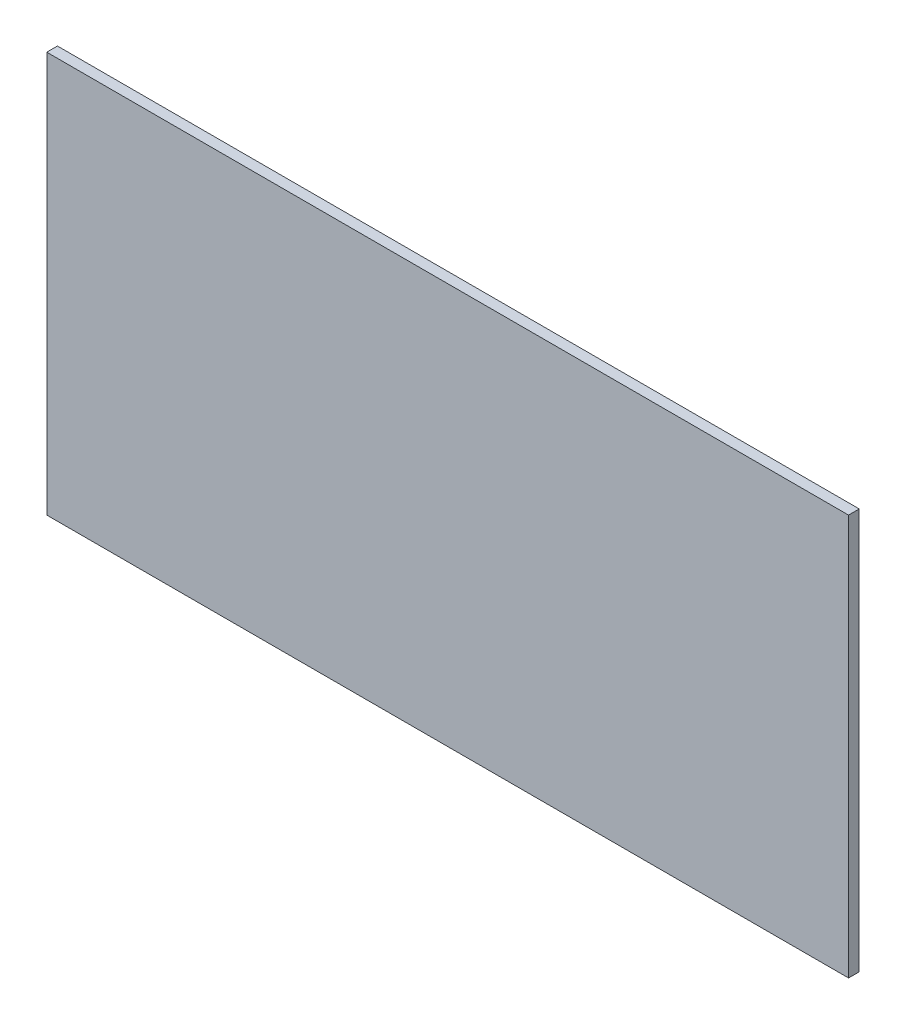
ISO-10303-21;
HEADER;
FILE_DESCRIPTION(('STEP AP214'),'2;1');
FILE_NAME('part.step','',(''),(''),'','','');
FILE_SCHEMA(('AUTOMOTIVE_DESIGN { 1 0 10303 214 1 1 1 1 }'));
ENDSEC;
DATA;
#1=APPLICATION_CONTEXT('core data for automotive mechanical design processes');
#2=APPLICATION_PROTOCOL_DEFINITION('international standard','automotive_design',2000,#1);
#3=PRODUCT_CONTEXT('',#1,'mechanical');
#4=PRODUCT('Part','Part','',(#3));
#5=PRODUCT_RELATED_PRODUCT_CATEGORY('part','',(#4));
#6=PRODUCT_DEFINITION_FORMATION('','',#4);
#7=PRODUCT_DEFINITION_CONTEXT('part definition',#1,'design');
#8=PRODUCT_DEFINITION('design','',#6,#7);
#9=PRODUCT_DEFINITION_SHAPE('','',#8);
#10=(LENGTH_UNIT() NAMED_UNIT(*) SI_UNIT(.MILLI.,.METRE.));
#11=(NAMED_UNIT(*) PLANE_ANGLE_UNIT() SI_UNIT($,.RADIAN.));
#12=(NAMED_UNIT(*) SI_UNIT($,.STERADIAN.) SOLID_ANGLE_UNIT());
#13=UNCERTAINTY_MEASURE_WITH_UNIT(LENGTH_MEASURE(1.E-05),#10,'distance_accuracy_value','');
#14=(GEOMETRIC_REPRESENTATION_CONTEXT(3) GLOBAL_UNCERTAINTY_ASSIGNED_CONTEXT((#13)) GLOBAL_UNIT_ASSIGNED_CONTEXT((#10,
#11,#12)) REPRESENTATION_CONTEXT('',''));
#15=CARTESIAN_POINT('',(0.,0.,0.));
#16=DIRECTION('',(0.,0.,1.));
#17=DIRECTION('',(1.,0.,0.));
#18=AXIS2_PLACEMENT_3D('',#15,#16,#17);
#19=CARTESIAN_POINT('',(450.,-225.,12.));
#20=DIRECTION('',(-1.,0.,0.));
#21=DIRECTION('',(0.,0.,1.));
#22=AXIS2_PLACEMENT_3D('',#19,#20,#21);
#23=PLANE('',#22);
#24=DIRECTION('',(0.,1.,0.));
#25=VECTOR('',#24,1.);
#26=CARTESIAN_POINT('',(450.,-225.,0.));
#27=LINE('',#26,#25);
#28=CARTESIAN_POINT('',(450.,-225.,0.));
#29=VERTEX_POINT('',#28);
#30=CARTESIAN_POINT('',(450.,225.,0.));
#31=VERTEX_POINT('',#30);
#32=EDGE_CURVE('E98',#29,#31,#27,.T.);
#33=ORIENTED_EDGE('',*,*,#32,.T.);
#34=DIRECTION('',(0.,0.,-1.));
#35=VECTOR('',#34,1.);
#36=CARTESIAN_POINT('',(450.,225.,12.));
#37=LINE('',#36,#35);
#38=CARTESIAN_POINT('',(450.,225.,12.));
#39=VERTEX_POINT('',#38);
#40=EDGE_CURVE('E11',#39,#31,#37,.T.);
#41=ORIENTED_EDGE('',*,*,#40,.F.);
#42=DIRECTION('',(0.,1.,0.));
#43=VECTOR('',#42,1.);
#44=CARTESIAN_POINT('',(450.,-225.,12.));
#45=LINE('',#44,#43);
#46=CARTESIAN_POINT('',(450.,-225.,12.));
#47=VERTEX_POINT('',#46);
#48=EDGE_CURVE('E86',#47,#39,#45,.T.);
#49=ORIENTED_EDGE('',*,*,#48,.F.);
#50=DIRECTION('',(0.,0.,-1.));
#51=VECTOR('',#50,1.);
#52=CARTESIAN_POINT('',(450.,-225.,12.));
#53=LINE('',#52,#51);
#54=EDGE_CURVE('E94',#47,#29,#53,.T.);
#55=ORIENTED_EDGE('',*,*,#54,.T.);
#56=EDGE_LOOP('',(#33,#41,#49,#55));
#57=FACE_BOUND('',#56,.T.);
#58=ADVANCED_FACE('F35',(#57),#23,.F.);
#59=CARTESIAN_POINT('',(-450.,225.,12.));
#60=DIRECTION('',(0.,-1.,0.));
#61=DIRECTION('',(0.,0.,-1.));
#62=AXIS2_PLACEMENT_3D('',#59,#60,#61);
#63=PLANE('',#62);
#64=DIRECTION('',(-1.,0.,0.));
#65=VECTOR('',#64,1.);
#66=CARTESIAN_POINT('',(-450.,225.,0.));
#67=LINE('',#66,#65);
#68=CARTESIAN_POINT('',(-450.,225.,0.));
#69=VERTEX_POINT('',#68);
#70=EDGE_CURVE('E90',#31,#69,#67,.T.);
#71=ORIENTED_EDGE('',*,*,#70,.T.);
#72=DIRECTION('',(0.,0.,-1.));
#73=VECTOR('',#72,1.);
#74=CARTESIAN_POINT('',(-450.,225.,12.));
#75=LINE('',#74,#73);
#76=CARTESIAN_POINT('',(-450.,225.,12.));
#77=VERTEX_POINT('',#76);
#78=EDGE_CURVE('E43',#77,#69,#75,.T.);
#79=ORIENTED_EDGE('',*,*,#78,.F.);
#80=DIRECTION('',(-1.,0.,0.));
#81=VECTOR('',#80,1.);
#82=CARTESIAN_POINT('',(-450.,225.,12.));
#83=LINE('',#82,#81);
#84=EDGE_CURVE('E81',#39,#77,#83,.T.);
#85=ORIENTED_EDGE('',*,*,#84,.F.);
#86=ORIENTED_EDGE('',*,*,#40,.T.);
#87=EDGE_LOOP('',(#71,#79,#85,#86));
#88=FACE_BOUND('',#87,.T.);
#89=ADVANCED_FACE('F89',(#88),#63,.F.);
#90=CARTESIAN_POINT('',(-450.,-225.,12.));
#91=DIRECTION('',(1.,0.,0.));
#92=DIRECTION('',(0.,0.,-1.));
#93=AXIS2_PLACEMENT_3D('',#90,#91,#92);
#94=PLANE('',#93);
#95=DIRECTION('',(0.,-1.,0.));
#96=VECTOR('',#95,1.);
#97=CARTESIAN_POINT('',(-450.,-225.,0.));
#98=LINE('',#97,#96);
#99=CARTESIAN_POINT('',(-450.,-225.,0.));
#100=VERTEX_POINT('',#99);
#101=EDGE_CURVE('E68',#69,#100,#98,.T.);
#102=ORIENTED_EDGE('',*,*,#101,.T.);
#103=DIRECTION('',(0.,0.,-1.));
#104=VECTOR('',#103,1.);
#105=CARTESIAN_POINT('',(-450.,-225.,12.));
#106=LINE('',#105,#104);
#107=CARTESIAN_POINT('',(-450.,-225.,12.));
#108=VERTEX_POINT('',#107);
#109=EDGE_CURVE('E91',#108,#100,#106,.T.);
#110=ORIENTED_EDGE('',*,*,#109,.F.);
#111=DIRECTION('',(0.,-1.,0.));
#112=VECTOR('',#111,1.);
#113=CARTESIAN_POINT('',(-450.,-225.,12.));
#114=LINE('',#113,#112);
#115=EDGE_CURVE('E84',#77,#108,#114,.T.);
#116=ORIENTED_EDGE('',*,*,#115,.F.);
#117=ORIENTED_EDGE('',*,*,#78,.T.);
#118=EDGE_LOOP('',(#102,#110,#116,#117));
#119=FACE_BOUND('',#118,.T.);
#120=ADVANCED_FACE('F92',(#119),#94,.F.);
#121=CARTESIAN_POINT('',(-450.,-225.,12.));
#122=DIRECTION('',(0.,1.,0.));
#123=DIRECTION('',(0.,0.,1.));
#124=AXIS2_PLACEMENT_3D('',#121,#122,#123);
#125=PLANE('',#124);
#126=DIRECTION('',(1.,0.,0.));
#127=VECTOR('',#126,1.);
#128=CARTESIAN_POINT('',(-450.,-225.,0.));
#129=LINE('',#128,#127);
#130=EDGE_CURVE('E74',#100,#29,#129,.T.);
#131=ORIENTED_EDGE('',*,*,#130,.T.);
#132=ORIENTED_EDGE('',*,*,#54,.F.);
#133=DIRECTION('',(1.,0.,0.));
#134=VECTOR('',#133,1.);
#135=CARTESIAN_POINT('',(-450.,-225.,12.));
#136=LINE('',#135,#134);
#137=EDGE_CURVE('E51',#108,#47,#136,.T.);
#138=ORIENTED_EDGE('',*,*,#137,.F.);
#139=ORIENTED_EDGE('',*,*,#109,.T.);
#140=EDGE_LOOP('',(#131,#132,#138,#139));
#141=FACE_BOUND('',#140,.T.);
#142=ADVANCED_FACE('F105',(#141),#125,.F.);
#143=CARTESIAN_POINT('',(0.,0.,12.));
#144=DIRECTION('',(0.,0.,-1.));
#145=DIRECTION('',(-1.,0.,0.));
#146=AXIS2_PLACEMENT_3D('',#143,#144,#145);
#147=PLANE('',#146);
#148=ORIENTED_EDGE('',*,*,#48,.T.);
#149=ORIENTED_EDGE('',*,*,#84,.T.);
#150=ORIENTED_EDGE('',*,*,#115,.T.);
#151=ORIENTED_EDGE('',*,*,#137,.T.);
#152=EDGE_LOOP('',(#148,#149,#150,#151));
#153=FACE_BOUND('',#152,.T.);
#154=ADVANCED_FACE('F82',(#153),#147,.F.);
#155=CARTESIAN_POINT('',(0.,0.,0.));
#156=DIRECTION('',(0.,0.,-1.));
#157=DIRECTION('',(-1.,0.,0.));
#158=AXIS2_PLACEMENT_3D('',#155,#156,#157);
#159=PLANE('',#158);
#160=ORIENTED_EDGE('',*,*,#32,.F.);
#161=ORIENTED_EDGE('',*,*,#130,.F.);
#162=ORIENTED_EDGE('',*,*,#101,.F.);
#163=ORIENTED_EDGE('',*,*,#70,.F.);
#164=EDGE_LOOP('',(#160,#161,#162,#163));
#165=FACE_BOUND('',#164,.T.);
#166=ADVANCED_FACE('F108',(#165),#159,.T.);
#167=CLOSED_SHELL('',(#58,#89,#120,#142,#154,#166));
#168=MANIFOLD_SOLID_BREP('B2',#167);
#169=ADVANCED_BREP_SHAPE_REPRESENTATION('',(#18,#168),#14);
#170=SHAPE_DEFINITION_REPRESENTATION(#9,#169);
ENDSEC;
END-ISO-10303-21;
